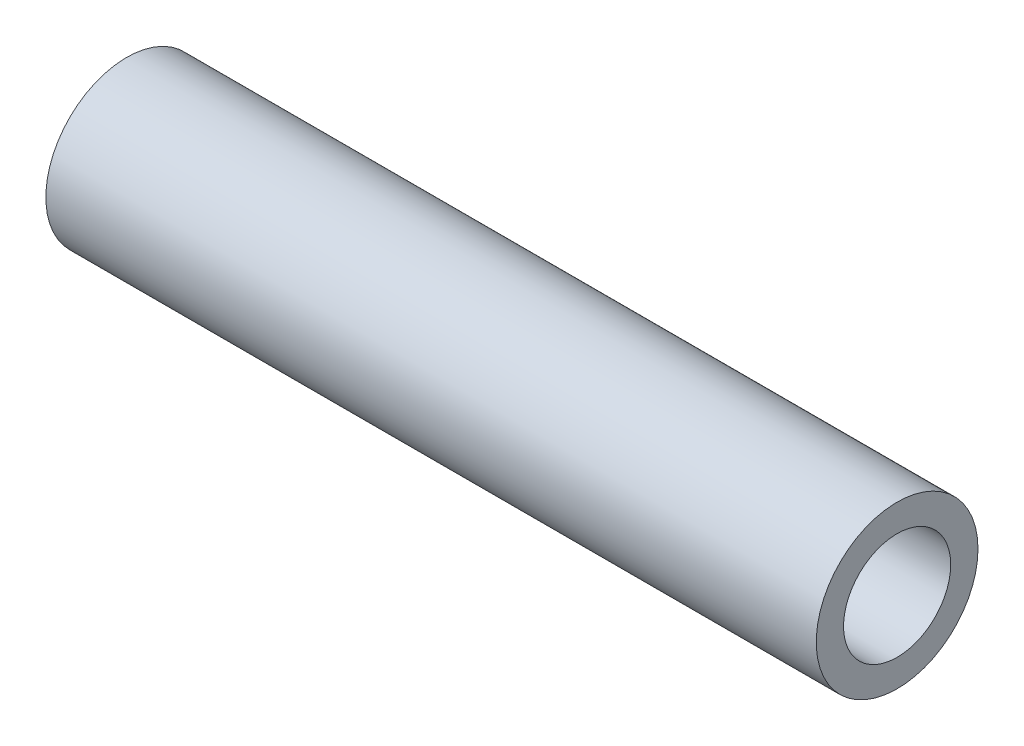
ISO-10303-21;
HEADER;
FILE_DESCRIPTION(('STEP AP214'),'2;1');
FILE_NAME('part.step','',(''),(''),'','','');
FILE_SCHEMA(('AUTOMOTIVE_DESIGN { 1 0 10303 214 1 1 1 1 }'));
ENDSEC;
DATA;
#1=APPLICATION_CONTEXT('core data for automotive mechanical design processes');
#2=APPLICATION_PROTOCOL_DEFINITION('international standard','automotive_design',2000,#1);
#3=PRODUCT_CONTEXT('',#1,'mechanical');
#4=PRODUCT('Part','Part','',(#3));
#5=PRODUCT_RELATED_PRODUCT_CATEGORY('part','',(#4));
#6=PRODUCT_DEFINITION_FORMATION('','',#4);
#7=PRODUCT_DEFINITION_CONTEXT('part definition',#1,'design');
#8=PRODUCT_DEFINITION('design','',#6,#7);
#9=PRODUCT_DEFINITION_SHAPE('','',#8);
#10=(LENGTH_UNIT() NAMED_UNIT(*) SI_UNIT(.MILLI.,.METRE.));
#11=(NAMED_UNIT(*) PLANE_ANGLE_UNIT() SI_UNIT($,.RADIAN.));
#12=(NAMED_UNIT(*) SI_UNIT($,.STERADIAN.) SOLID_ANGLE_UNIT());
#13=UNCERTAINTY_MEASURE_WITH_UNIT(LENGTH_MEASURE(1.E-05),#10,'distance_accuracy_value','');
#14=(GEOMETRIC_REPRESENTATION_CONTEXT(3) GLOBAL_UNCERTAINTY_ASSIGNED_CONTEXT((#13)) GLOBAL_UNIT_ASSIGNED_CONTEXT((#10,
#11,#12)) REPRESENTATION_CONTEXT('',''));
#15=CARTESIAN_POINT('',(0.,0.,0.));
#16=DIRECTION('',(0.,0.,1.));
#17=DIRECTION('',(1.,0.,0.));
#18=AXIS2_PLACEMENT_3D('',#15,#16,#17);
#19=CARTESIAN_POINT('',(38.1,0.,0.));
#20=DIRECTION('',(1.,0.,0.));
#21=DIRECTION('',(0.,0.,-1.));
#22=AXIS2_PLACEMENT_3D('',#19,#20,#21);
#23=PLANE('',#22);
#24=CARTESIAN_POINT('',(38.1,0.,0.));
#25=DIRECTION('',(1.,0.,0.));
#26=DIRECTION('',(0.,0.,-1.));
#27=AXIS2_PLACEMENT_3D('',#24,#25,#26);
#28=CIRCLE('',#27,4.);
#29=CARTESIAN_POINT('',(38.1,0.,-4.));
#30=VERTEX_POINT('',#29);
#31=EDGE_CURVE('E10',#30,#30,#28,.T.);
#32=ORIENTED_EDGE('',*,*,#31,.T.);
#33=EDGE_LOOP('',(#32));
#34=FACE_BOUND('',#33,.T.);
#35=CARTESIAN_POINT('',(38.1,0.,0.));
#36=DIRECTION('',(1.,0.,0.));
#37=DIRECTION('',(0.,0.,-1.));
#38=AXIS2_PLACEMENT_3D('',#35,#36,#37);
#39=CIRCLE('',#38,2.65);
#40=CARTESIAN_POINT('',(38.1,0.,-2.65));
#41=VERTEX_POINT('',#40);
#42=EDGE_CURVE('E42',#41,#41,#39,.T.);
#43=ORIENTED_EDGE('',*,*,#42,.F.);
#44=EDGE_LOOP('',(#43));
#45=FACE_BOUND('',#44,.T.);
#46=ADVANCED_FACE('F31',(#34,#45),#23,.T.);
#47=CARTESIAN_POINT('',(0.,0.,0.));
#48=DIRECTION('',(1.,0.,0.));
#49=DIRECTION('',(0.,0.,-1.));
#50=AXIS2_PLACEMENT_3D('',#47,#48,#49);
#51=PLANE('',#50);
#52=CARTESIAN_POINT('',(0.,0.,0.));
#53=DIRECTION('',(1.,0.,0.));
#54=DIRECTION('',(0.,0.,-1.));
#55=AXIS2_PLACEMENT_3D('',#52,#53,#54);
#56=CIRCLE('',#55,4.);
#57=CARTESIAN_POINT('',(0.,0.,-4.));
#58=VERTEX_POINT('',#57);
#59=EDGE_CURVE('E35',#58,#58,#56,.T.);
#60=ORIENTED_EDGE('',*,*,#59,.F.);
#61=EDGE_LOOP('',(#60));
#62=FACE_BOUND('',#61,.T.);
#63=CARTESIAN_POINT('',(0.,0.,0.));
#64=DIRECTION('',(1.,0.,0.));
#65=DIRECTION('',(0.,0.,-1.));
#66=AXIS2_PLACEMENT_3D('',#63,#64,#65);
#67=CIRCLE('',#66,2.65);
#68=CARTESIAN_POINT('',(0.,0.,-2.65));
#69=VERTEX_POINT('',#68);
#70=EDGE_CURVE('E44',#69,#69,#67,.T.);
#71=ORIENTED_EDGE('',*,*,#70,.T.);
#72=EDGE_LOOP('',(#71));
#73=FACE_BOUND('',#72,.T.);
#74=ADVANCED_FACE('F54',(#62,#73),#51,.F.);
#75=CARTESIAN_POINT('',(38.1,0.,0.));
#76=DIRECTION('',(-1.,0.,0.));
#77=DIRECTION('',(0.,0.,1.));
#78=AXIS2_PLACEMENT_3D('',#75,#76,#77);
#79=CYLINDRICAL_SURFACE('',#78,4.);
#80=ORIENTED_EDGE('',*,*,#31,.F.);
#81=EDGE_LOOP('',(#80));
#82=FACE_BOUND('',#81,.T.);
#83=ORIENTED_EDGE('',*,*,#59,.T.);
#84=EDGE_LOOP('',(#83));
#85=FACE_BOUND('',#84,.T.);
#86=ADVANCED_FACE('F33',(#82,#85),#79,.T.);
#87=CARTESIAN_POINT('',(38.1,0.,0.));
#88=DIRECTION('',(-1.,0.,0.));
#89=DIRECTION('',(0.,0.,1.));
#90=AXIS2_PLACEMENT_3D('',#87,#88,#89);
#91=CYLINDRICAL_SURFACE('',#90,2.65);
#92=ORIENTED_EDGE('',*,*,#42,.T.);
#93=EDGE_LOOP('',(#92));
#94=FACE_BOUND('',#93,.T.);
#95=ORIENTED_EDGE('',*,*,#70,.F.);
#96=EDGE_LOOP('',(#95));
#97=FACE_BOUND('',#96,.T.);
#98=ADVANCED_FACE('F50',(#94,#97),#91,.F.);
#99=CLOSED_SHELL('',(#46,#74,#86,#98));
#100=MANIFOLD_SOLID_BREP('B2',#99);
#101=ADVANCED_BREP_SHAPE_REPRESENTATION('',(#18,#100),#14);
#102=SHAPE_DEFINITION_REPRESENTATION(#9,#101);
ENDSEC;
END-ISO-10303-21;
